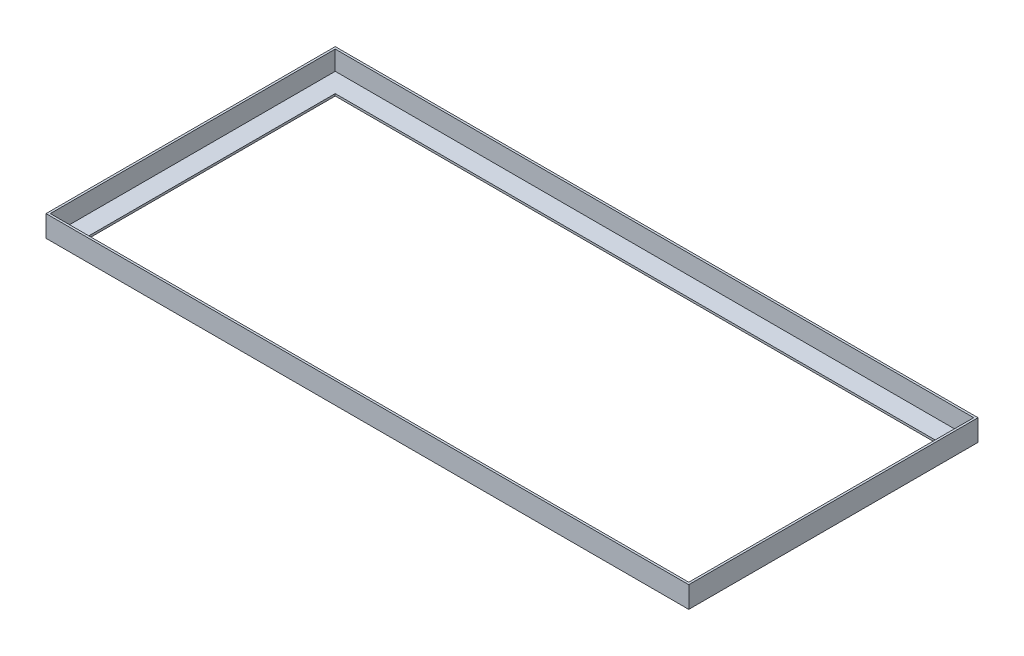
ISO-10303-21;
HEADER;
FILE_DESCRIPTION(('STEP AP214'),'2;1');
FILE_NAME('part.step','',(''),(''),'','','');
FILE_SCHEMA(('AUTOMOTIVE_DESIGN { 1 0 10303 214 1 1 1 1 }'));
ENDSEC;
DATA;
#1=APPLICATION_CONTEXT('core data for automotive mechanical design processes');
#2=APPLICATION_PROTOCOL_DEFINITION('international standard','automotive_design',2000,#1);
#3=PRODUCT_CONTEXT('',#1,'mechanical');
#4=PRODUCT('Part','Part','',(#3));
#5=PRODUCT_RELATED_PRODUCT_CATEGORY('part','',(#4));
#6=PRODUCT_DEFINITION_FORMATION('','',#4);
#7=PRODUCT_DEFINITION_CONTEXT('part definition',#1,'design');
#8=PRODUCT_DEFINITION('design','',#6,#7);
#9=PRODUCT_DEFINITION_SHAPE('','',#8);
#10=(LENGTH_UNIT() NAMED_UNIT(*) SI_UNIT(.MILLI.,.METRE.));
#11=(NAMED_UNIT(*) PLANE_ANGLE_UNIT() SI_UNIT($,.RADIAN.));
#12=(NAMED_UNIT(*) SI_UNIT($,.STERADIAN.) SOLID_ANGLE_UNIT());
#13=UNCERTAINTY_MEASURE_WITH_UNIT(LENGTH_MEASURE(1.E-05),#10,'distance_accuracy_value','');
#14=(GEOMETRIC_REPRESENTATION_CONTEXT(3) GLOBAL_UNCERTAINTY_ASSIGNED_CONTEXT((#13)) GLOBAL_UNIT_ASSIGNED_CONTEXT((#10,
#11,#12)) REPRESENTATION_CONTEXT('',''));
#15=CARTESIAN_POINT('',(0.,0.,0.));
#16=DIRECTION('',(0.,0.,1.));
#17=DIRECTION('',(1.,0.,0.));
#18=AXIS2_PLACEMENT_3D('',#15,#16,#17);
#19=CARTESIAN_POINT('',(-78.9001000112778,15.6650035046458,-270.));
#20=DIRECTION('',(-1.,0.,0.));
#21=DIRECTION('',(0.,0.,1.));
#22=AXIS2_PLACEMENT_3D('',#19,#20,#21);
#23=PLANE('',#22);
#24=DIRECTION('',(0.,-1.,0.));
#25=VECTOR('',#24,1.);
#26=CARTESIAN_POINT('',(-78.9001000112778,15.6650035046458,0.));
#27=LINE('',#26,#25);
#28=CARTESIAN_POINT('',(-78.9001000112778,15.6650035046458,0.));
#29=VERTEX_POINT('',#28);
#30=CARTESIAN_POINT('',(-78.9001000112778,-4.33499649535423,0.));
#31=VERTEX_POINT('',#30);
#32=EDGE_CURVE('E181',#29,#31,#27,.T.);
#33=ORIENTED_EDGE('',*,*,#32,.F.);
#34=DIRECTION('',(0.,0.,1.));
#35=VECTOR('',#34,1.);
#36=CARTESIAN_POINT('',(-78.9001000112778,15.6650035046458,-270.));
#37=LINE('',#36,#35);
#38=CARTESIAN_POINT('',(-78.9001000112778,15.6650035046458,-270.));
#39=VERTEX_POINT('',#38);
#40=EDGE_CURVE('E12',#39,#29,#37,.T.);
#41=ORIENTED_EDGE('',*,*,#40,.F.);
#42=DIRECTION('',(0.,-1.,0.));
#43=VECTOR('',#42,1.);
#44=CARTESIAN_POINT('',(-78.9001000112778,15.6650035046458,-270.));
#45=LINE('',#44,#43);
#46=CARTESIAN_POINT('',(-78.9001000112778,-4.33499649535423,-270.));
#47=VERTEX_POINT('',#46);
#48=EDGE_CURVE('E223',#39,#47,#45,.T.);
#49=ORIENTED_EDGE('',*,*,#48,.T.);
#50=DIRECTION('',(0.,0.,1.));
#51=VECTOR('',#50,1.);
#52=CARTESIAN_POINT('',(-78.9001000112778,-4.33499649535423,-270.));
#53=LINE('',#52,#51);
#54=EDGE_CURVE('E38',#47,#31,#53,.T.);
#55=ORIENTED_EDGE('',*,*,#54,.T.);
#56=EDGE_LOOP('',(#33,#41,#49,#55));
#57=FACE_BOUND('',#56,.T.);
#58=ADVANCED_FACE('F35',(#57),#23,.T.);
#59=CARTESIAN_POINT('',(-78.9001000112778,15.6650035046458,-270.));
#60=DIRECTION('',(0.,1.,0.));
#61=DIRECTION('',(0.,0.,1.));
#62=AXIS2_PLACEMENT_3D('',#59,#60,#61);
#63=PLANE('',#62);
#64=DIRECTION('',(1.,0.,0.));
#65=VECTOR('',#64,1.);
#66=CARTESIAN_POINT('',(519.099899988722,15.6650035046458,-268.));
#67=LINE('',#66,#65);
#68=CARTESIAN_POINT('',(-76.9001000112778,15.6650035046458,-268.));
#69=VERTEX_POINT('',#68);
#70=CARTESIAN_POINT('',(519.099899988722,15.6650035046458,-268.));
#71=VERTEX_POINT('',#70);
#72=EDGE_CURVE('E170',#69,#71,#67,.T.);
#73=ORIENTED_EDGE('',*,*,#72,.T.);
#74=DIRECTION('',(0.,0.,1.));
#75=VECTOR('',#74,1.);
#76=CARTESIAN_POINT('',(519.099899988722,15.6650035046458,-268.));
#77=LINE('',#76,#75);
#78=CARTESIAN_POINT('',(519.099899988722,15.6650035046458,-2.));
#79=VERTEX_POINT('',#78);
#80=EDGE_CURVE('E178',#71,#79,#77,.T.);
#81=ORIENTED_EDGE('',*,*,#80,.T.);
#82=DIRECTION('',(-1.,0.,0.));
#83=VECTOR('',#82,1.);
#84=CARTESIAN_POINT('',(519.099899988722,15.6650035046458,-2.));
#85=LINE('',#84,#83);
#86=CARTESIAN_POINT('',(-76.9001000112778,15.6650035046458,-2.));
#87=VERTEX_POINT('',#86);
#88=EDGE_CURVE('E188',#79,#87,#85,.T.);
#89=ORIENTED_EDGE('',*,*,#88,.T.);
#90=DIRECTION('',(0.,0.,-1.));
#91=VECTOR('',#90,1.);
#92=CARTESIAN_POINT('',(-76.9001000112778,15.6650035046458,-268.));
#93=LINE('',#92,#91);
#94=EDGE_CURVE('E204',#87,#69,#93,.T.);
#95=ORIENTED_EDGE('',*,*,#94,.T.);
#96=EDGE_LOOP('',(#73,#81,#89,#95));
#97=FACE_BOUND('',#96,.T.);
#98=DIRECTION('',(-1.,0.,0.));
#99=VECTOR('',#98,1.);
#100=CARTESIAN_POINT('',(-78.9001000112778,15.6650035046458,0.));
#101=LINE('',#100,#99);
#102=CARTESIAN_POINT('',(521.099899988722,15.6650035046458,0.));
#103=VERTEX_POINT('',#102);
#104=EDGE_CURVE('E227',#103,#29,#101,.T.);
#105=ORIENTED_EDGE('',*,*,#104,.F.);
#106=DIRECTION('',(0.,0.,1.));
#107=VECTOR('',#106,1.);
#108=CARTESIAN_POINT('',(521.099899988722,15.6650035046458,-270.));
#109=LINE('',#108,#107);
#110=CARTESIAN_POINT('',(521.099899988722,15.6650035046458,-270.));
#111=VERTEX_POINT('',#110);
#112=EDGE_CURVE('E43',#111,#103,#109,.T.);
#113=ORIENTED_EDGE('',*,*,#112,.F.);
#114=DIRECTION('',(-1.,0.,0.));
#115=VECTOR('',#114,1.);
#116=CARTESIAN_POINT('',(-78.9001000112778,15.6650035046458,-270.));
#117=LINE('',#116,#115);
#118=EDGE_CURVE('E233',#111,#39,#117,.T.);
#119=ORIENTED_EDGE('',*,*,#118,.T.);
#120=ORIENTED_EDGE('',*,*,#40,.T.);
#121=EDGE_LOOP('',(#105,#113,#119,#120));
#122=FACE_BOUND('',#121,.T.);
#123=ADVANCED_FACE('F257',(#97,#122),#63,.T.);
#124=CARTESIAN_POINT('',(521.099899988722,15.6650035046458,-270.));
#125=DIRECTION('',(1.,0.,0.));
#126=DIRECTION('',(0.,0.,-1.));
#127=AXIS2_PLACEMENT_3D('',#124,#125,#126);
#128=PLANE('',#127);
#129=DIRECTION('',(0.,1.,0.));
#130=VECTOR('',#129,1.);
#131=CARTESIAN_POINT('',(521.099899988722,15.6650035046458,0.));
#132=LINE('',#131,#130);
#133=CARTESIAN_POINT('',(521.099899988722,-4.33499649535423,0.));
#134=VERTEX_POINT('',#133);
#135=EDGE_CURVE('E241',#134,#103,#132,.T.);
#136=ORIENTED_EDGE('',*,*,#135,.F.);
#137=DIRECTION('',(0.,0.,1.));
#138=VECTOR('',#137,1.);
#139=CARTESIAN_POINT('',(521.099899988722,-4.33499649535423,-270.));
#140=LINE('',#139,#138);
#141=CARTESIAN_POINT('',(521.099899988722,-4.33499649535423,-270.));
#142=VERTEX_POINT('',#141);
#143=EDGE_CURVE('E246',#142,#134,#140,.T.);
#144=ORIENTED_EDGE('',*,*,#143,.F.);
#145=DIRECTION('',(0.,1.,0.));
#146=VECTOR('',#145,1.);
#147=CARTESIAN_POINT('',(521.099899988722,15.6650035046458,-270.));
#148=LINE('',#147,#146);
#149=EDGE_CURVE('E230',#142,#111,#148,.T.);
#150=ORIENTED_EDGE('',*,*,#149,.T.);
#151=ORIENTED_EDGE('',*,*,#112,.T.);
#152=EDGE_LOOP('',(#136,#144,#150,#151));
#153=FACE_BOUND('',#152,.T.);
#154=ADVANCED_FACE('F263',(#153),#128,.T.);
#155=CARTESIAN_POINT('',(-78.9001000112778,-4.33499649535423,-270.));
#156=DIRECTION('',(0.,-1.,0.));
#157=DIRECTION('',(1.,0.,0.));
#158=AXIS2_PLACEMENT_3D('',#155,#156,#157);
#159=PLANE('',#158);
#160=DIRECTION('',(-1.,0.,0.));
#161=VECTOR('',#160,1.);
#162=CARTESIAN_POINT('',(501.099899988722,-4.33499649535428,-20.));
#163=LINE('',#162,#161);
#164=CARTESIAN_POINT('',(501.099899988722,-4.33499649535428,-20.));
#165=VERTEX_POINT('',#164);
#166=CARTESIAN_POINT('',(-58.9001000112778,-4.33499649535423,-20.));
#167=VERTEX_POINT('',#166);
#168=EDGE_CURVE('E163',#165,#167,#163,.T.);
#169=ORIENTED_EDGE('',*,*,#168,.F.);
#170=DIRECTION('',(0.,0.,1.));
#171=VECTOR('',#170,1.);
#172=CARTESIAN_POINT('',(501.099899988722,-4.33499649535428,-250.));
#173=LINE('',#172,#171);
#174=CARTESIAN_POINT('',(501.099899988722,-4.33499649535428,-250.));
#175=VERTEX_POINT('',#174);
#176=EDGE_CURVE('E140',#175,#165,#173,.T.);
#177=ORIENTED_EDGE('',*,*,#176,.F.);
#178=DIRECTION('',(1.,0.,0.));
#179=VECTOR('',#178,1.);
#180=CARTESIAN_POINT('',(-58.9001000112778,-4.33499649535428,-250.));
#181=LINE('',#180,#179);
#182=CARTESIAN_POINT('',(-58.9001000112778,-4.33499649535428,-250.));
#183=VERTEX_POINT('',#182);
#184=EDGE_CURVE('E132',#183,#175,#181,.T.);
#185=ORIENTED_EDGE('',*,*,#184,.F.);
#186=DIRECTION('',(0.,0.,-1.));
#187=VECTOR('',#186,1.);
#188=CARTESIAN_POINT('',(-58.9001000112778,-4.33499649535428,-20.));
#189=LINE('',#188,#187);
#190=EDGE_CURVE('E121',#167,#183,#189,.T.);
#191=ORIENTED_EDGE('',*,*,#190,.F.);
#192=EDGE_LOOP('',(#169,#177,#185,#191));
#193=FACE_BOUND('',#192,.T.);
#194=DIRECTION('',(1.,0.,0.));
#195=VECTOR('',#194,1.);
#196=CARTESIAN_POINT('',(-78.9001000112778,-4.33499649535423,0.));
#197=LINE('',#196,#195);
#198=EDGE_CURVE('E238',#31,#134,#197,.T.);
#199=ORIENTED_EDGE('',*,*,#198,.F.);
#200=ORIENTED_EDGE('',*,*,#54,.F.);
#201=DIRECTION('',(1.,0.,0.));
#202=VECTOR('',#201,1.);
#203=CARTESIAN_POINT('',(-78.9001000112778,-4.33499649535423,-270.));
#204=LINE('',#203,#202);
#205=EDGE_CURVE('E226',#47,#142,#204,.T.);
#206=ORIENTED_EDGE('',*,*,#205,.T.);
#207=ORIENTED_EDGE('',*,*,#143,.T.);
#208=EDGE_LOOP('',(#199,#200,#206,#207));
#209=FACE_BOUND('',#208,.T.);
#210=ADVANCED_FACE('F138',(#193,#209),#159,.T.);
#211=CARTESIAN_POINT('',(0.,0.,-270.));
#212=DIRECTION('',(0.,0.,1.));
#213=DIRECTION('',(1.,0.,0.));
#214=AXIS2_PLACEMENT_3D('',#211,#212,#213);
#215=PLANE('',#214);
#216=ORIENTED_EDGE('',*,*,#48,.F.);
#217=ORIENTED_EDGE('',*,*,#118,.F.);
#218=ORIENTED_EDGE('',*,*,#149,.F.);
#219=ORIENTED_EDGE('',*,*,#205,.F.);
#220=EDGE_LOOP('',(#216,#217,#218,#219));
#221=FACE_BOUND('',#220,.T.);
#222=ADVANCED_FACE('F260',(#221),#215,.F.);
#223=CARTESIAN_POINT('',(0.,0.,0.));
#224=DIRECTION('',(0.,0.,1.));
#225=DIRECTION('',(1.,0.,0.));
#226=AXIS2_PLACEMENT_3D('',#223,#224,#225);
#227=PLANE('',#226);
#228=ORIENTED_EDGE('',*,*,#32,.T.);
#229=ORIENTED_EDGE('',*,*,#198,.T.);
#230=ORIENTED_EDGE('',*,*,#135,.T.);
#231=ORIENTED_EDGE('',*,*,#104,.T.);
#232=EDGE_LOOP('',(#228,#229,#230,#231));
#233=FACE_BOUND('',#232,.T.);
#234=ADVANCED_FACE('F254',(#233),#227,.T.);
#235=CARTESIAN_POINT('',(0.,-2.33499649535428,0.));
#236=DIRECTION('',(0.,-1.,0.));
#237=DIRECTION('',(0.,0.,-1.));
#238=AXIS2_PLACEMENT_3D('',#235,#236,#237);
#239=PLANE('',#238);
#240=DIRECTION('',(0.,0.,1.));
#241=VECTOR('',#240,1.);
#242=CARTESIAN_POINT('',(501.099899988722,-2.33499649535428,-250.));
#243=LINE('',#242,#241);
#244=CARTESIAN_POINT('',(501.099899988722,-2.33499649535428,-250.));
#245=VERTEX_POINT('',#244);
#246=CARTESIAN_POINT('',(501.099899988722,-2.33499649535428,-20.));
#247=VERTEX_POINT('',#246);
#248=EDGE_CURVE('E141',#245,#247,#243,.T.);
#249=ORIENTED_EDGE('',*,*,#248,.T.);
#250=DIRECTION('',(-1.,0.,0.));
#251=VECTOR('',#250,1.);
#252=CARTESIAN_POINT('',(501.099899988722,-2.33499649535428,-20.));
#253=LINE('',#252,#251);
#254=CARTESIAN_POINT('',(-58.9001000112778,-2.33499649535428,-20.));
#255=VERTEX_POINT('',#254);
#256=EDGE_CURVE('E162',#247,#255,#253,.T.);
#257=ORIENTED_EDGE('',*,*,#256,.T.);
#258=DIRECTION('',(0.,0.,-1.));
#259=VECTOR('',#258,1.);
#260=CARTESIAN_POINT('',(-58.9001000112778,-2.33499649535428,-20.));
#261=LINE('',#260,#259);
#262=CARTESIAN_POINT('',(-58.9001000112778,-2.33499649535428,-250.));
#263=VERTEX_POINT('',#262);
#264=EDGE_CURVE('E126',#255,#263,#261,.T.);
#265=ORIENTED_EDGE('',*,*,#264,.T.);
#266=DIRECTION('',(1.,0.,0.));
#267=VECTOR('',#266,1.);
#268=CARTESIAN_POINT('',(-58.9001000112778,-2.33499649535428,-250.));
#269=LINE('',#268,#267);
#270=EDGE_CURVE('E127',#263,#245,#269,.T.);
#271=ORIENTED_EDGE('',*,*,#270,.T.);
#272=EDGE_LOOP('',(#249,#257,#265,#271));
#273=FACE_BOUND('',#272,.T.);
#274=DIRECTION('',(1.,0.,0.));
#275=VECTOR('',#274,1.);
#276=CARTESIAN_POINT('',(519.099899988722,-2.33499649535423,-268.));
#277=LINE('',#276,#275);
#278=CARTESIAN_POINT('',(-76.9001000112778,-2.33499649535423,-268.));
#279=VERTEX_POINT('',#278);
#280=CARTESIAN_POINT('',(519.099899988722,-2.33499649535423,-268.));
#281=VERTEX_POINT('',#280);
#282=EDGE_CURVE('E196',#279,#281,#277,.T.);
#283=ORIENTED_EDGE('',*,*,#282,.F.);
#284=DIRECTION('',(0.,0.,-1.));
#285=VECTOR('',#284,1.);
#286=CARTESIAN_POINT('',(-76.9001000112778,-2.33499649535423,-268.));
#287=LINE('',#286,#285);
#288=CARTESIAN_POINT('',(-76.9001000112778,-2.33499649535423,-2.));
#289=VERTEX_POINT('',#288);
#290=EDGE_CURVE('E169',#289,#279,#287,.T.);
#291=ORIENTED_EDGE('',*,*,#290,.F.);
#292=DIRECTION('',(-1.,0.,0.));
#293=VECTOR('',#292,1.);
#294=CARTESIAN_POINT('',(519.099899988722,-2.33499649535423,-2.));
#295=LINE('',#294,#293);
#296=CARTESIAN_POINT('',(519.099899988722,-2.33499649535423,-2.));
#297=VERTEX_POINT('',#296);
#298=EDGE_CURVE('E189',#297,#289,#295,.T.);
#299=ORIENTED_EDGE('',*,*,#298,.F.);
#300=DIRECTION('',(0.,0.,1.));
#301=VECTOR('',#300,1.);
#302=CARTESIAN_POINT('',(519.099899988722,-2.33499649535423,-268.));
#303=LINE('',#302,#301);
#304=EDGE_CURVE('E182',#281,#297,#303,.T.);
#305=ORIENTED_EDGE('',*,*,#304,.F.);
#306=EDGE_LOOP('',(#283,#291,#299,#305));
#307=FACE_BOUND('',#306,.T.);
#308=ADVANCED_FACE('F296',(#273,#307),#239,.F.);
#309=CARTESIAN_POINT('',(519.099899988722,15.6650035046458,-268.));
#310=DIRECTION('',(0.,0.,-1.));
#311=DIRECTION('',(-1.,0.,0.));
#312=AXIS2_PLACEMENT_3D('',#309,#310,#311);
#313=PLANE('',#312);
#314=ORIENTED_EDGE('',*,*,#282,.T.);
#315=DIRECTION('',(0.,-1.,0.));
#316=VECTOR('',#315,1.);
#317=CARTESIAN_POINT('',(519.099899988722,15.6650035046458,-268.));
#318=LINE('',#317,#316);
#319=EDGE_CURVE('E166',#71,#281,#318,.T.);
#320=ORIENTED_EDGE('',*,*,#319,.F.);
#321=ORIENTED_EDGE('',*,*,#72,.F.);
#322=DIRECTION('',(0.,-1.,0.));
#323=VECTOR('',#322,1.);
#324=CARTESIAN_POINT('',(-76.9001000112778,15.6650035046458,-268.));
#325=LINE('',#324,#323);
#326=EDGE_CURVE('E175',#69,#279,#325,.T.);
#327=ORIENTED_EDGE('',*,*,#326,.T.);
#328=EDGE_LOOP('',(#314,#320,#321,#327));
#329=FACE_BOUND('',#328,.T.);
#330=ADVANCED_FACE('F290',(#329),#313,.F.);
#331=CARTESIAN_POINT('',(-76.9001000112778,15.6650035046458,-268.));
#332=DIRECTION('',(-1.,0.,0.));
#333=DIRECTION('',(0.,0.,1.));
#334=AXIS2_PLACEMENT_3D('',#331,#332,#333);
#335=PLANE('',#334);
#336=ORIENTED_EDGE('',*,*,#290,.T.);
#337=ORIENTED_EDGE('',*,*,#326,.F.);
#338=ORIENTED_EDGE('',*,*,#94,.F.);
#339=DIRECTION('',(0.,-1.,0.));
#340=VECTOR('',#339,1.);
#341=CARTESIAN_POINT('',(-76.9001000112778,15.6650035046458,-2.));
#342=LINE('',#341,#340);
#343=EDGE_CURVE('E207',#87,#289,#342,.T.);
#344=ORIENTED_EDGE('',*,*,#343,.T.);
#345=EDGE_LOOP('',(#336,#337,#338,#344));
#346=FACE_BOUND('',#345,.T.);
#347=ADVANCED_FACE('F295',(#346),#335,.F.);
#348=CARTESIAN_POINT('',(519.099899988722,15.6650035046458,-2.));
#349=DIRECTION('',(0.,0.,1.));
#350=DIRECTION('',(1.,0.,0.));
#351=AXIS2_PLACEMENT_3D('',#348,#349,#350);
#352=PLANE('',#351);
#353=ORIENTED_EDGE('',*,*,#298,.T.);
#354=ORIENTED_EDGE('',*,*,#343,.F.);
#355=ORIENTED_EDGE('',*,*,#88,.F.);
#356=DIRECTION('',(0.,-1.,0.));
#357=VECTOR('',#356,1.);
#358=CARTESIAN_POINT('',(519.099899988722,15.6650035046458,-2.));
#359=LINE('',#358,#357);
#360=EDGE_CURVE('E185',#79,#297,#359,.T.);
#361=ORIENTED_EDGE('',*,*,#360,.T.);
#362=EDGE_LOOP('',(#353,#354,#355,#361));
#363=FACE_BOUND('',#362,.T.);
#364=ADVANCED_FACE('F308',(#363),#352,.F.);
#365=CARTESIAN_POINT('',(519.099899988722,15.6650035046458,-268.));
#366=DIRECTION('',(1.,0.,0.));
#367=DIRECTION('',(0.,0.,-1.));
#368=AXIS2_PLACEMENT_3D('',#365,#366,#367);
#369=PLANE('',#368);
#370=ORIENTED_EDGE('',*,*,#304,.T.);
#371=ORIENTED_EDGE('',*,*,#360,.F.);
#372=ORIENTED_EDGE('',*,*,#80,.F.);
#373=ORIENTED_EDGE('',*,*,#319,.T.);
#374=EDGE_LOOP('',(#370,#371,#372,#373));
#375=FACE_BOUND('',#374,.T.);
#376=ADVANCED_FACE('F318',(#375),#369,.F.);
#377=CARTESIAN_POINT('',(501.099899988722,-2.33499649535428,-20.));
#378=DIRECTION('',(0.,0.,1.));
#379=DIRECTION('',(1.,0.,0.));
#380=AXIS2_PLACEMENT_3D('',#377,#378,#379);
#381=PLANE('',#380);
#382=ORIENTED_EDGE('',*,*,#168,.T.);
#383=DIRECTION('',(0.,-1.,0.));
#384=VECTOR('',#383,1.);
#385=CARTESIAN_POINT('',(-58.9001000112778,-2.33499649535428,-20.));
#386=LINE('',#385,#384);
#387=EDGE_CURVE('E56',#255,#167,#386,.T.);
#388=ORIENTED_EDGE('',*,*,#387,.F.);
#389=ORIENTED_EDGE('',*,*,#256,.F.);
#390=DIRECTION('',(0.,-1.,0.));
#391=VECTOR('',#390,1.);
#392=CARTESIAN_POINT('',(501.099899988722,-2.33499649535428,-20.));
#393=LINE('',#392,#391);
#394=EDGE_CURVE('E159',#247,#165,#393,.T.);
#395=ORIENTED_EDGE('',*,*,#394,.T.);
#396=EDGE_LOOP('',(#382,#388,#389,#395));
#397=FACE_BOUND('',#396,.T.);
#398=ADVANCED_FACE('F328',(#397),#381,.F.);
#399=CARTESIAN_POINT('',(501.099899988722,-2.33499649535428,-250.));
#400=DIRECTION('',(1.,0.,0.));
#401=DIRECTION('',(0.,0.,-1.));
#402=AXIS2_PLACEMENT_3D('',#399,#400,#401);
#403=PLANE('',#402);
#404=ORIENTED_EDGE('',*,*,#176,.T.);
#405=ORIENTED_EDGE('',*,*,#394,.F.);
#406=ORIENTED_EDGE('',*,*,#248,.F.);
#407=DIRECTION('',(0.,-1.,0.));
#408=VECTOR('',#407,1.);
#409=CARTESIAN_POINT('',(501.099899988722,-2.33499649535428,-250.));
#410=LINE('',#409,#408);
#411=EDGE_CURVE('E144',#245,#175,#410,.T.);
#412=ORIENTED_EDGE('',*,*,#411,.T.);
#413=EDGE_LOOP('',(#404,#405,#406,#412));
#414=FACE_BOUND('',#413,.T.);
#415=ADVANCED_FACE('F353',(#414),#403,.F.);
#416=CARTESIAN_POINT('',(-58.9001000112778,-2.33499649535428,-250.));
#417=DIRECTION('',(0.,0.,-1.));
#418=DIRECTION('',(-1.,0.,0.));
#419=AXIS2_PLACEMENT_3D('',#416,#417,#418);
#420=PLANE('',#419);
#421=ORIENTED_EDGE('',*,*,#184,.T.);
#422=ORIENTED_EDGE('',*,*,#411,.F.);
#423=ORIENTED_EDGE('',*,*,#270,.F.);
#424=DIRECTION('',(0.,-1.,0.));
#425=VECTOR('',#424,1.);
#426=CARTESIAN_POINT('',(-58.9001000112778,-2.33499649535428,-250.));
#427=LINE('',#426,#425);
#428=EDGE_CURVE('E51',#263,#183,#427,.T.);
#429=ORIENTED_EDGE('',*,*,#428,.T.);
#430=EDGE_LOOP('',(#421,#422,#423,#429));
#431=FACE_BOUND('',#430,.T.);
#432=ADVANCED_FACE('F130',(#431),#420,.F.);
#433=CARTESIAN_POINT('',(-58.9001000112778,-2.33499649535428,-20.));
#434=DIRECTION('',(-1.,0.,0.));
#435=DIRECTION('',(0.,0.,1.));
#436=AXIS2_PLACEMENT_3D('',#433,#434,#435);
#437=PLANE('',#436);
#438=ORIENTED_EDGE('',*,*,#190,.T.);
#439=ORIENTED_EDGE('',*,*,#428,.F.);
#440=ORIENTED_EDGE('',*,*,#264,.F.);
#441=ORIENTED_EDGE('',*,*,#387,.T.);
#442=EDGE_LOOP('',(#438,#439,#440,#441));
#443=FACE_BOUND('',#442,.T.);
#444=ADVANCED_FACE('F122',(#443),#437,.F.);
#445=CLOSED_SHELL('',(#58,#123,#154,#210,#222,#234,#308,#330,#347,#364,#376,#398,#415,#432,#444));
#446=MANIFOLD_SOLID_BREP('B2',#445);
#447=ADVANCED_BREP_SHAPE_REPRESENTATION('',(#18,#446),#14);
#448=SHAPE_DEFINITION_REPRESENTATION(#9,#447);
ENDSEC;
END-ISO-10303-21;
